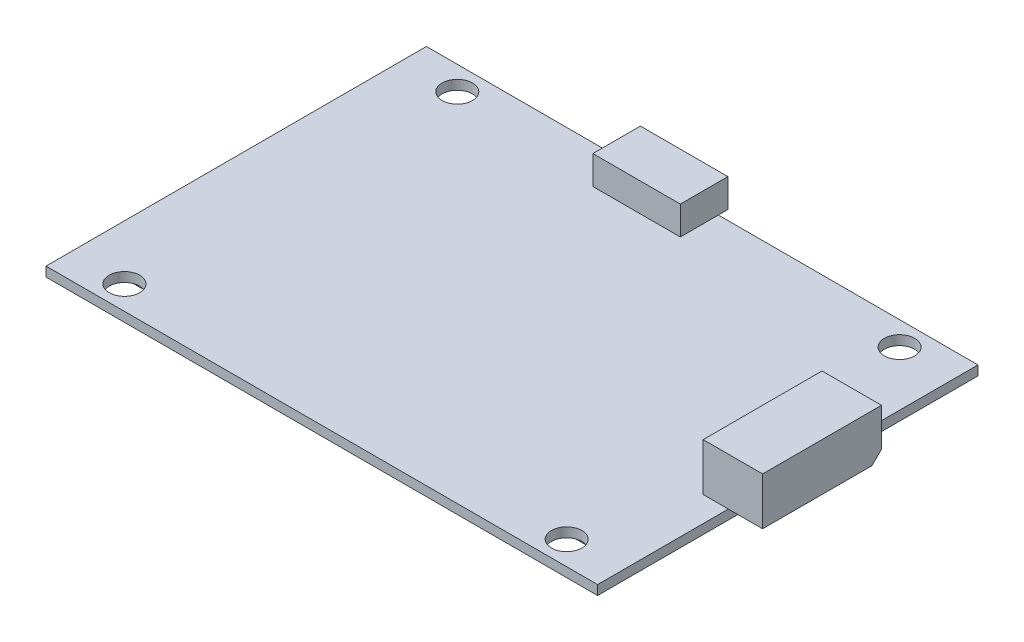
ISO-10303-21;
HEADER;
FILE_DESCRIPTION(('STEP AP214'),'2;1');
FILE_NAME('part.step','',(''),(''),'','','');
FILE_SCHEMA(('AUTOMOTIVE_DESIGN { 1 0 10303 214 1 1 1 1 }'));
ENDSEC;
DATA;
#1=APPLICATION_CONTEXT('core data for automotive mechanical design processes');
#2=APPLICATION_PROTOCOL_DEFINITION('international standard','automotive_design',2000,#1);
#3=PRODUCT_CONTEXT('',#1,'mechanical');
#4=PRODUCT('Part','Part','',(#3));
#5=PRODUCT_RELATED_PRODUCT_CATEGORY('part','',(#4));
#6=PRODUCT_DEFINITION_FORMATION('','',#4);
#7=PRODUCT_DEFINITION_CONTEXT('part definition',#1,'design');
#8=PRODUCT_DEFINITION('design','',#6,#7);
#9=PRODUCT_DEFINITION_SHAPE('','',#8);
#10=(LENGTH_UNIT() NAMED_UNIT(*) SI_UNIT(.MILLI.,.METRE.));
#11=(NAMED_UNIT(*) PLANE_ANGLE_UNIT() SI_UNIT($,.RADIAN.));
#12=(NAMED_UNIT(*) SI_UNIT($,.STERADIAN.) SOLID_ANGLE_UNIT());
#13=UNCERTAINTY_MEASURE_WITH_UNIT(LENGTH_MEASURE(1.E-05),#10,'distance_accuracy_value','');
#14=(GEOMETRIC_REPRESENTATION_CONTEXT(3) GLOBAL_UNCERTAINTY_ASSIGNED_CONTEXT((#13)) GLOBAL_UNIT_ASSIGNED_CONTEXT((#10,
#11,#12)) REPRESENTATION_CONTEXT('',''));
#15=CARTESIAN_POINT('',(0.,0.,0.));
#16=DIRECTION('',(0.,0.,1.));
#17=DIRECTION('',(1.,0.,0.));
#18=AXIS2_PLACEMENT_3D('',#15,#16,#17);
#19=CARTESIAN_POINT('',(0.,0.,0.));
#20=DIRECTION('',(0.,1.,0.));
#21=DIRECTION('',(0.,0.,1.));
#22=AXIS2_PLACEMENT_3D('',#19,#20,#21);
#23=PLANE('',#22);
#24=CARTESIAN_POINT('',(23.25,0.,-17.5));
#25=DIRECTION('',(0.,1.,0.));
#26=DIRECTION('',(0.,0.,1.));
#27=AXIS2_PLACEMENT_3D('',#24,#25,#26);
#28=CIRCLE('',#27,1.6);
#29=CARTESIAN_POINT('',(23.25,0.,-15.9));
#30=VERTEX_POINT('',#29);
#31=EDGE_CURVE('E923',#30,#30,#28,.T.);
#32=ORIENTED_EDGE('',*,*,#31,.T.);
#33=EDGE_LOOP('',(#32));
#34=FACE_BOUND('',#33,.T.);
#35=CARTESIAN_POINT('',(23.25,0.,17.5));
#36=DIRECTION('',(0.,1.,0.));
#37=DIRECTION('',(0.,0.,1.));
#38=AXIS2_PLACEMENT_3D('',#35,#36,#37);
#39=CIRCLE('',#38,1.6);
#40=CARTESIAN_POINT('',(23.25,0.,19.1));
#41=VERTEX_POINT('',#40);
#42=EDGE_CURVE('E924',#41,#41,#39,.T.);
#43=ORIENTED_EDGE('',*,*,#42,.T.);
#44=EDGE_LOOP('',(#43));
#45=FACE_BOUND('',#44,.T.);
#46=CARTESIAN_POINT('',(-23.25,0.,17.5));
#47=DIRECTION('',(0.,1.,0.));
#48=DIRECTION('',(0.,0.,1.));
#49=AXIS2_PLACEMENT_3D('',#46,#47,#48);
#50=CIRCLE('',#49,1.6);
#51=CARTESIAN_POINT('',(-23.25,0.,19.1));
#52=VERTEX_POINT('',#51);
#53=EDGE_CURVE('E928',#52,#52,#50,.T.);
#54=ORIENTED_EDGE('',*,*,#53,.T.);
#55=EDGE_LOOP('',(#54));
#56=FACE_BOUND('',#55,.T.);
#57=CARTESIAN_POINT('',(-23.25,0.,-17.5));
#58=DIRECTION('',(0.,1.,0.));
#59=DIRECTION('',(0.,0.,1.));
#60=AXIS2_PLACEMENT_3D('',#57,#58,#59);
#61=CIRCLE('',#60,1.6);
#62=CARTESIAN_POINT('',(-23.25,0.,-15.9));
#63=VERTEX_POINT('',#62);
#64=EDGE_CURVE('E943',#63,#63,#61,.T.);
#65=ORIENTED_EDGE('',*,*,#64,.T.);
#66=EDGE_LOOP('',(#65));
#67=FACE_BOUND('',#66,.T.);
#68=DIRECTION('',(0.,0.,-1.));
#69=VECTOR('',#68,1.);
#70=CARTESIAN_POINT('',(17.5,0.,12.));
#71=LINE('',#70,#69);
#72=CARTESIAN_POINT('',(17.5,0.,12.));
#73=VERTEX_POINT('',#72);
#74=CARTESIAN_POINT('',(17.5,0.,5.4));
#75=VERTEX_POINT('',#74);
#76=EDGE_CURVE('E260',#73,#75,#71,.T.);
#77=ORIENTED_EDGE('',*,*,#76,.F.);
#78=DIRECTION('',(-1.,0.,0.));
#79=VECTOR('',#78,1.);
#80=CARTESIAN_POINT('',(17.5,0.,12.));
#81=LINE('',#80,#79);
#82=CARTESIAN_POINT('',(22.5,0.,12.));
#83=VERTEX_POINT('',#82);
#84=EDGE_CURVE('E273',#83,#73,#81,.T.);
#85=ORIENTED_EDGE('',*,*,#84,.F.);
#86=DIRECTION('',(0.,0.,1.));
#87=VECTOR('',#86,1.);
#88=CARTESIAN_POINT('',(22.5,0.,12.));
#89=LINE('',#88,#87);
#90=CARTESIAN_POINT('',(22.5,0.,5.4));
#91=VERTEX_POINT('',#90);
#92=EDGE_CURVE('E282',#91,#83,#89,.T.);
#93=ORIENTED_EDGE('',*,*,#92,.F.);
#94=DIRECTION('',(1.,0.,0.));
#95=VECTOR('',#94,1.);
#96=CARTESIAN_POINT('',(17.5,0.,5.4));
#97=LINE('',#96,#95);
#98=EDGE_CURVE('E263',#75,#91,#97,.T.);
#99=ORIENTED_EDGE('',*,*,#98,.F.);
#100=EDGE_LOOP('',(#77,#85,#93,#99));
#101=FACE_BOUND('',#100,.T.);
#102=DIRECTION('',(0.,0.,-1.));
#103=VECTOR('',#102,1.);
#104=CARTESIAN_POINT('',(-28.,0.,12.));
#105=LINE('',#104,#103);
#106=CARTESIAN_POINT('',(-28.,0.,12.));
#107=VERTEX_POINT('',#106);
#108=CARTESIAN_POINT('',(-28.,0.,5.4));
#109=VERTEX_POINT('',#108);
#110=EDGE_CURVE('E331',#107,#109,#105,.T.);
#111=ORIENTED_EDGE('',*,*,#110,.F.);
#112=DIRECTION('',(-1.,0.,0.));
#113=VECTOR('',#112,1.);
#114=CARTESIAN_POINT('',(-28.,0.,12.));
#115=LINE('',#114,#113);
#116=CARTESIAN_POINT('',(-23.,0.,12.));
#117=VERTEX_POINT('',#116);
#118=EDGE_CURVE('E336',#117,#107,#115,.T.);
#119=ORIENTED_EDGE('',*,*,#118,.F.);
#120=DIRECTION('',(0.,0.,1.));
#121=VECTOR('',#120,1.);
#122=CARTESIAN_POINT('',(-23.,0.,12.));
#123=LINE('',#122,#121);
#124=CARTESIAN_POINT('',(-23.,0.,5.4));
#125=VERTEX_POINT('',#124);
#126=EDGE_CURVE('E348',#125,#117,#123,.T.);
#127=ORIENTED_EDGE('',*,*,#126,.F.);
#128=DIRECTION('',(1.,0.,0.));
#129=VECTOR('',#128,1.);
#130=CARTESIAN_POINT('',(-28.,0.,5.4));
#131=LINE('',#130,#129);
#132=EDGE_CURVE('E345',#109,#125,#131,.T.);
#133=ORIENTED_EDGE('',*,*,#132,.F.);
#134=EDGE_LOOP('',(#111,#119,#127,#133));
#135=FACE_BOUND('',#134,.T.);
#136=DIRECTION('',(0.,0.,1.));
#137=VECTOR('',#136,1.);
#138=CARTESIAN_POINT('',(-29.,0.,20.));
#139=LINE('',#138,#137);
#140=CARTESIAN_POINT('',(-29.,0.,-20.));
#141=VERTEX_POINT('',#140);
#142=CARTESIAN_POINT('',(-29.,0.,20.));
#143=VERTEX_POINT('',#142);
#144=EDGE_CURVE('E432',#141,#143,#139,.T.);
#145=ORIENTED_EDGE('',*,*,#144,.F.);
#146=DIRECTION('',(-1.,0.,0.));
#147=VECTOR('',#146,1.);
#148=CARTESIAN_POINT('',(29.,0.,-20.));
#149=LINE('',#148,#147);
#150=CARTESIAN_POINT('',(29.,0.,-20.));
#151=VERTEX_POINT('',#150);
#152=EDGE_CURVE('E437',#151,#141,#149,.T.);
#153=ORIENTED_EDGE('',*,*,#152,.F.);
#154=DIRECTION('',(0.,0.,-1.));
#155=VECTOR('',#154,1.);
#156=CARTESIAN_POINT('',(29.,0.,20.));
#157=LINE('',#156,#155);
#158=CARTESIAN_POINT('',(29.,0.,20.));
#159=VERTEX_POINT('',#158);
#160=EDGE_CURVE('E453',#159,#151,#157,.T.);
#161=ORIENTED_EDGE('',*,*,#160,.F.);
#162=DIRECTION('',(1.,0.,0.));
#163=VECTOR('',#162,1.);
#164=CARTESIAN_POINT('',(29.,0.,20.));
#165=LINE('',#164,#163);
#166=EDGE_CURVE('E451',#143,#159,#165,.T.);
#167=ORIENTED_EDGE('',*,*,#166,.F.);
#168=EDGE_LOOP('',(#145,#153,#161,#167));
#169=FACE_BOUND('',#168,.T.);
#170=DIRECTION('',(0.,0.,-1.));
#171=VECTOR('',#170,1.);
#172=CARTESIAN_POINT('',(-28.,0.,-5.6));
#173=LINE('',#172,#171);
#174=CARTESIAN_POINT('',(-28.,0.,-5.6));
#175=VERTEX_POINT('',#174);
#176=CARTESIAN_POINT('',(-28.,0.,-12.2));
#177=VERTEX_POINT('',#176);
#178=EDGE_CURVE('E298',#175,#177,#173,.T.);
#179=ORIENTED_EDGE('',*,*,#178,.F.);
#180=DIRECTION('',(-1.,0.,0.));
#181=VECTOR('',#180,1.);
#182=CARTESIAN_POINT('',(-28.,0.,-5.6));
#183=LINE('',#182,#181);
#184=CARTESIAN_POINT('',(-23.,0.,-5.6));
#185=VERTEX_POINT('',#184);
#186=EDGE_CURVE('E303',#185,#175,#183,.T.);
#187=ORIENTED_EDGE('',*,*,#186,.F.);
#188=DIRECTION('',(0.,0.,1.));
#189=VECTOR('',#188,1.);
#190=CARTESIAN_POINT('',(-23.,0.,-5.6));
#191=LINE('',#190,#189);
#192=CARTESIAN_POINT('',(-23.,0.,-12.2));
#193=VERTEX_POINT('',#192);
#194=EDGE_CURVE('E315',#193,#185,#191,.T.);
#195=ORIENTED_EDGE('',*,*,#194,.F.);
#196=DIRECTION('',(1.,0.,0.));
#197=VECTOR('',#196,1.);
#198=CARTESIAN_POINT('',(-28.,0.,-12.2));
#199=LINE('',#198,#197);
#200=EDGE_CURVE('E312',#177,#193,#199,.T.);
#201=ORIENTED_EDGE('',*,*,#200,.F.);
#202=EDGE_LOOP('',(#179,#187,#195,#201));
#203=FACE_BOUND('',#202,.T.);
#204=DIRECTION('',(0.,0.,-1.));
#205=VECTOR('',#204,1.);
#206=CARTESIAN_POINT('',(17.5,0.,-5.6));
#207=LINE('',#206,#205);
#208=CARTESIAN_POINT('',(17.5,0.,-5.6));
#209=VERTEX_POINT('',#208);
#210=CARTESIAN_POINT('',(17.5,0.,-12.2));
#211=VERTEX_POINT('',#210);
#212=EDGE_CURVE('E259',#209,#211,#207,.T.);
#213=ORIENTED_EDGE('',*,*,#212,.F.);
#214=DIRECTION('',(-1.,0.,0.));
#215=VECTOR('',#214,1.);
#216=CARTESIAN_POINT('',(17.5,0.,-5.6));
#217=LINE('',#216,#215);
#218=CARTESIAN_POINT('',(22.5,0.,-5.6));
#219=VERTEX_POINT('',#218);
#220=EDGE_CURVE('E256',#219,#209,#217,.T.);
#221=ORIENTED_EDGE('',*,*,#220,.F.);
#222=DIRECTION('',(0.,0.,1.));
#223=VECTOR('',#222,1.);
#224=CARTESIAN_POINT('',(22.5,0.,-5.6));
#225=LINE('',#224,#223);
#226=CARTESIAN_POINT('',(22.5,0.,-12.2));
#227=VERTEX_POINT('',#226);
#228=EDGE_CURVE('E53',#227,#219,#225,.T.);
#229=ORIENTED_EDGE('',*,*,#228,.F.);
#230=DIRECTION('',(1.,0.,0.));
#231=VECTOR('',#230,1.);
#232=CARTESIAN_POINT('',(17.5,0.,-12.2));
#233=LINE('',#232,#231);
#234=EDGE_CURVE('E48',#211,#227,#233,.T.);
#235=ORIENTED_EDGE('',*,*,#234,.F.);
#236=EDGE_LOOP('',(#213,#221,#229,#235));
#237=FACE_BOUND('',#236,.T.);
#238=ADVANCED_FACE('F33',(#34,#45,#56,#67,#101,#135,#169,#203,#237),#23,.F.);
#239=CARTESIAN_POINT('',(0.,1.,0.));
#240=DIRECTION('',(0.,1.,0.));
#241=DIRECTION('',(0.,0.,1.));
#242=AXIS2_PLACEMENT_3D('',#239,#240,#241);
#243=PLANE('',#242);
#244=CARTESIAN_POINT('',(23.25,1.,-17.5));
#245=DIRECTION('',(0.,1.,0.));
#246=DIRECTION('',(0.,0.,1.));
#247=AXIS2_PLACEMENT_3D('',#244,#245,#246);
#248=CIRCLE('',#247,1.6);
#249=CARTESIAN_POINT('',(23.25,1.,-15.9));
#250=VERTEX_POINT('',#249);
#251=EDGE_CURVE('E921',#250,#250,#248,.T.);
#252=ORIENTED_EDGE('',*,*,#251,.F.);
#253=EDGE_LOOP('',(#252));
#254=FACE_BOUND('',#253,.T.);
#255=CARTESIAN_POINT('',(23.25,1.,17.5));
#256=DIRECTION('',(0.,1.,0.));
#257=DIRECTION('',(0.,0.,1.));
#258=AXIS2_PLACEMENT_3D('',#255,#256,#257);
#259=CIRCLE('',#258,1.6);
#260=CARTESIAN_POINT('',(23.25,1.,19.1));
#261=VERTEX_POINT('',#260);
#262=EDGE_CURVE('E951',#261,#261,#259,.T.);
#263=ORIENTED_EDGE('',*,*,#262,.F.);
#264=EDGE_LOOP('',(#263));
#265=FACE_BOUND('',#264,.T.);
#266=CARTESIAN_POINT('',(-23.25,1.,17.5));
#267=DIRECTION('',(0.,1.,0.));
#268=DIRECTION('',(0.,0.,1.));
#269=AXIS2_PLACEMENT_3D('',#266,#267,#268);
#270=CIRCLE('',#269,1.6);
#271=CARTESIAN_POINT('',(-23.25,1.,19.1));
#272=VERTEX_POINT('',#271);
#273=EDGE_CURVE('E949',#272,#272,#270,.T.);
#274=ORIENTED_EDGE('',*,*,#273,.F.);
#275=EDGE_LOOP('',(#274));
#276=FACE_BOUND('',#275,.T.);
#277=CARTESIAN_POINT('',(-23.25,1.,-17.5));
#278=DIRECTION('',(0.,1.,0.));
#279=DIRECTION('',(0.,0.,1.));
#280=AXIS2_PLACEMENT_3D('',#277,#278,#279);
#281=CIRCLE('',#280,1.6);
#282=CARTESIAN_POINT('',(-23.25,1.,-15.9));
#283=VERTEX_POINT('',#282);
#284=EDGE_CURVE('E946',#283,#283,#281,.T.);
#285=ORIENTED_EDGE('',*,*,#284,.F.);
#286=EDGE_LOOP('',(#285));
#287=FACE_BOUND('',#286,.T.);
#288=DIRECTION('',(1.,0.,0.));
#289=VECTOR('',#288,1.);
#290=CARTESIAN_POINT('',(-7.50000000000001,1.,-16.));
#291=LINE('',#290,#289);
#292=CARTESIAN_POINT('',(-7.50000000000001,1.,-16.));
#293=VERTEX_POINT('',#292);
#294=CARTESIAN_POINT('',(1.69999999999999,1.,-16.));
#295=VERTEX_POINT('',#294);
#296=EDGE_CURVE('E378',#293,#295,#291,.T.);
#297=ORIENTED_EDGE('',*,*,#296,.F.);
#298=DIRECTION('',(0.,0.,-1.));
#299=VECTOR('',#298,1.);
#300=CARTESIAN_POINT('',(-7.5,1.,0.));
#301=LINE('',#300,#299);
#302=CARTESIAN_POINT('',(-7.50000000000001,1.,-20.));
#303=VERTEX_POINT('',#302);
#304=EDGE_CURVE('E11',#293,#303,#301,.T.);
#305=ORIENTED_EDGE('',*,*,#304,.T.);
#306=DIRECTION('',(-1.,0.,0.));
#307=VECTOR('',#306,1.);
#308=CARTESIAN_POINT('',(29.,1.,-20.));
#309=LINE('',#308,#307);
#310=CARTESIAN_POINT('',(-29.,1.,-20.));
#311=VERTEX_POINT('',#310);
#312=EDGE_CURVE('E442',#303,#311,#309,.T.);
#313=ORIENTED_EDGE('',*,*,#312,.T.);
#314=DIRECTION('',(0.,0.,1.));
#315=VECTOR('',#314,1.);
#316=CARTESIAN_POINT('',(-29.,1.,20.));
#317=LINE('',#316,#315);
#318=CARTESIAN_POINT('',(-29.,1.,20.));
#319=VERTEX_POINT('',#318);
#320=EDGE_CURVE('E433',#311,#319,#317,.T.);
#321=ORIENTED_EDGE('',*,*,#320,.T.);
#322=DIRECTION('',(1.,0.,0.));
#323=VECTOR('',#322,1.);
#324=CARTESIAN_POINT('',(29.,1.,20.));
#325=LINE('',#324,#323);
#326=CARTESIAN_POINT('',(29.,1.,20.));
#327=VERTEX_POINT('',#326);
#328=EDGE_CURVE('E436',#319,#327,#325,.T.);
#329=ORIENTED_EDGE('',*,*,#328,.T.);
#330=DIRECTION('',(0.,0.,-1.));
#331=VECTOR('',#330,1.);
#332=CARTESIAN_POINT('',(29.,1.,20.));
#333=LINE('',#332,#331);
#334=CARTESIAN_POINT('',(29.,1.,6.25));
#335=VERTEX_POINT('',#334);
#336=EDGE_CURVE('E440',#327,#335,#333,.T.);
#337=ORIENTED_EDGE('',*,*,#336,.T.);
#338=DIRECTION('',(1.,0.,0.));
#339=VECTOR('',#338,1.);
#340=CARTESIAN_POINT('',(26.35,1.,6.25));
#341=LINE('',#340,#339);
#342=CARTESIAN_POINT('',(26.35,1.,6.25));
#343=VERTEX_POINT('',#342);
#344=EDGE_CURVE('E411',#343,#335,#341,.T.);
#345=ORIENTED_EDGE('',*,*,#344,.F.);
#346=DIRECTION('',(0.,0.,1.));
#347=VECTOR('',#346,1.);
#348=CARTESIAN_POINT('',(26.35,1.,-6.25));
#349=LINE('',#348,#347);
#350=CARTESIAN_POINT('',(26.35,1.,-6.25));
#351=VERTEX_POINT('',#350);
#352=EDGE_CURVE('E396',#351,#343,#349,.T.);
#353=ORIENTED_EDGE('',*,*,#352,.F.);
#354=DIRECTION('',(-1.,0.,0.));
#355=VECTOR('',#354,1.);
#356=CARTESIAN_POINT('',(26.35,1.,-6.25));
#357=LINE('',#356,#355);
#358=CARTESIAN_POINT('',(29.,1.,-6.25));
#359=VERTEX_POINT('',#358);
#360=EDGE_CURVE('E416',#359,#351,#357,.T.);
#361=ORIENTED_EDGE('',*,*,#360,.F.);
#362=CARTESIAN_POINT('',(29.,1.,-20.));
#363=VERTEX_POINT('',#362);
#364=EDGE_CURVE('E439',#359,#363,#333,.T.);
#365=ORIENTED_EDGE('',*,*,#364,.T.);
#366=CARTESIAN_POINT('',(1.69999999999999,1.,-20.));
#367=VERTEX_POINT('',#366);
#368=EDGE_CURVE('E444',#363,#367,#309,.T.);
#369=ORIENTED_EDGE('',*,*,#368,.T.);
#370=DIRECTION('',(0.,0.,-1.));
#371=VECTOR('',#370,1.);
#372=CARTESIAN_POINT('',(1.69999999999999,1.,-21.));
#373=LINE('',#372,#371);
#374=EDGE_CURVE('E382',#295,#367,#373,.T.);
#375=ORIENTED_EDGE('',*,*,#374,.F.);
#376=EDGE_LOOP('',(#297,#305,#313,#321,#329,#337,#345,#353,#361,#365,#369,#375));
#377=FACE_BOUND('',#376,.T.);
#378=ADVANCED_FACE('F505',(#254,#265,#276,#287,#377),#243,.T.);
#379=CARTESIAN_POINT('',(-29.,1.,20.));
#380=DIRECTION('',(1.,0.,0.));
#381=DIRECTION('',(0.,0.,-1.));
#382=AXIS2_PLACEMENT_3D('',#379,#380,#381);
#383=PLANE('',#382);
#384=ORIENTED_EDGE('',*,*,#144,.T.);
#385=DIRECTION('',(0.,-1.,0.));
#386=VECTOR('',#385,1.);
#387=CARTESIAN_POINT('',(-29.,1.,20.));
#388=LINE('',#387,#386);
#389=EDGE_CURVE('E420',#319,#143,#388,.T.);
#390=ORIENTED_EDGE('',*,*,#389,.F.);
#391=ORIENTED_EDGE('',*,*,#320,.F.);
#392=DIRECTION('',(0.,-1.,0.));
#393=VECTOR('',#392,1.);
#394=CARTESIAN_POINT('',(-29.,1.,-20.));
#395=LINE('',#394,#393);
#396=EDGE_CURVE('E447',#311,#141,#395,.T.);
#397=ORIENTED_EDGE('',*,*,#396,.T.);
#398=EDGE_LOOP('',(#384,#390,#391,#397));
#399=FACE_BOUND('',#398,.T.);
#400=ADVANCED_FACE('F522',(#399),#383,.F.);
#401=CARTESIAN_POINT('',(29.,1.,20.));
#402=DIRECTION('',(0.,0.,-1.));
#403=DIRECTION('',(-1.,0.,0.));
#404=AXIS2_PLACEMENT_3D('',#401,#402,#403);
#405=PLANE('',#404);
#406=ORIENTED_EDGE('',*,*,#166,.T.);
#407=DIRECTION('',(0.,-1.,0.));
#408=VECTOR('',#407,1.);
#409=CARTESIAN_POINT('',(29.,1.,20.));
#410=LINE('',#409,#408);
#411=EDGE_CURVE('E461',#327,#159,#410,.T.);
#412=ORIENTED_EDGE('',*,*,#411,.F.);
#413=ORIENTED_EDGE('',*,*,#328,.F.);
#414=ORIENTED_EDGE('',*,*,#389,.T.);
#415=EDGE_LOOP('',(#406,#412,#413,#414));
#416=FACE_BOUND('',#415,.T.);
#417=ADVANCED_FACE('F569',(#416),#405,.F.);
#418=CARTESIAN_POINT('',(29.,1.,20.));
#419=DIRECTION('',(-1.,0.,0.));
#420=DIRECTION('',(0.,0.,1.));
#421=AXIS2_PLACEMENT_3D('',#418,#419,#420);
#422=PLANE('',#421);
#423=ORIENTED_EDGE('',*,*,#160,.T.);
#424=DIRECTION('',(0.,-1.,0.));
#425=VECTOR('',#424,1.);
#426=CARTESIAN_POINT('',(29.,1.,-20.));
#427=LINE('',#426,#425);
#428=EDGE_CURVE('E458',#363,#151,#427,.T.);
#429=ORIENTED_EDGE('',*,*,#428,.F.);
#430=ORIENTED_EDGE('',*,*,#364,.F.);
#431=DIRECTION('',(0.,-1.,0.));
#432=VECTOR('',#431,1.);
#433=CARTESIAN_POINT('',(29.,6.,-6.25));
#434=LINE('',#433,#432);
#435=CARTESIAN_POINT('',(29.,2.,-6.25));
#436=VERTEX_POINT('',#435);
#437=EDGE_CURVE('E419',#436,#359,#434,.T.);
#438=ORIENTED_EDGE('',*,*,#437,.F.);
#439=DIRECTION('',(0.,0.707106781186548,-0.707106781186548));
#440=VECTOR('',#439,1.);
#441=CARTESIAN_POINT('',(29.,-11.625,7.375));
#442=LINE('',#441,#440);
#443=CARTESIAN_POINT('',(29.,1.,-5.25));
#444=VERTEX_POINT('',#443);
#445=EDGE_CURVE('E41',#436,#444,#442,.F.);
#446=ORIENTED_EDGE('',*,*,#445,.T.);
#447=EDGE_CURVE('E443',#335,#444,#333,.T.);
#448=ORIENTED_EDGE('',*,*,#447,.F.);
#449=ORIENTED_EDGE('',*,*,#336,.F.);
#450=ORIENTED_EDGE('',*,*,#411,.T.);
#451=EDGE_LOOP('',(#423,#429,#430,#438,#446,#448,#449,#450));
#452=FACE_BOUND('',#451,.T.);
#453=ADVANCED_FACE('F477',(#452),#422,.F.);
#454=CARTESIAN_POINT('',(29.,1.,-20.));
#455=DIRECTION('',(0.,0.,1.));
#456=DIRECTION('',(1.,0.,0.));
#457=AXIS2_PLACEMENT_3D('',#454,#455,#456);
#458=PLANE('',#457);
#459=ORIENTED_EDGE('',*,*,#152,.T.);
#460=ORIENTED_EDGE('',*,*,#396,.F.);
#461=ORIENTED_EDGE('',*,*,#312,.F.);
#462=EDGE_CURVE('E448',#367,#303,#309,.T.);
#463=ORIENTED_EDGE('',*,*,#462,.F.);
#464=ORIENTED_EDGE('',*,*,#368,.F.);
#465=ORIENTED_EDGE('',*,*,#428,.T.);
#466=EDGE_LOOP('',(#459,#460,#461,#463,#464,#465));
#467=FACE_BOUND('',#466,.T.);
#468=ADVANCED_FACE('F517',(#467),#458,.F.);
#469=CARTESIAN_POINT('',(0.,1.,0.));
#470=DIRECTION('',(0.,1.,0.));
#471=DIRECTION('',(0.,0.,1.));
#472=AXIS2_PLACEMENT_3D('',#469,#470,#471);
#473=PLANE('',#472);
#474=ORIENTED_EDGE('',*,*,#447,.T.);
#475=DIRECTION('',(1.,0.,0.));
#476=VECTOR('',#475,1.);
#477=CARTESIAN_POINT('',(0.,1.,-5.25));
#478=LINE('',#477,#476);
#479=CARTESIAN_POINT('',(32.6,1.,-5.25));
#480=VERTEX_POINT('',#479);
#481=EDGE_CURVE('E470',#444,#480,#478,.T.);
#482=ORIENTED_EDGE('',*,*,#481,.T.);
#483=DIRECTION('',(0.,0.,-1.));
#484=VECTOR('',#483,1.);
#485=CARTESIAN_POINT('',(32.6,1.,-6.25));
#486=LINE('',#485,#484);
#487=CARTESIAN_POINT('',(32.6,1.,6.25));
#488=VERTEX_POINT('',#487);
#489=EDGE_CURVE('E401',#488,#480,#486,.T.);
#490=ORIENTED_EDGE('',*,*,#489,.F.);
#491=EDGE_CURVE('E410',#335,#488,#341,.T.);
#492=ORIENTED_EDGE('',*,*,#491,.F.);
#493=EDGE_LOOP('',(#474,#482,#490,#492));
#494=FACE_BOUND('',#493,.T.);
#495=ADVANCED_FACE('F485',(#494),#473,.F.);
#496=CARTESIAN_POINT('',(26.35,6.,-6.25));
#497=DIRECTION('',(1.,0.,0.));
#498=DIRECTION('',(0.,0.,-1.));
#499=AXIS2_PLACEMENT_3D('',#496,#497,#498);
#500=PLANE('',#499);
#501=ORIENTED_EDGE('',*,*,#352,.T.);
#502=DIRECTION('',(0.,-1.,0.));
#503=VECTOR('',#502,1.);
#504=CARTESIAN_POINT('',(26.35,6.,6.25));
#505=LINE('',#504,#503);
#506=CARTESIAN_POINT('',(26.35,6.,6.25));
#507=VERTEX_POINT('',#506);
#508=EDGE_CURVE('E429',#507,#343,#505,.T.);
#509=ORIENTED_EDGE('',*,*,#508,.F.);
#510=DIRECTION('',(0.,0.,1.));
#511=VECTOR('',#510,1.);
#512=CARTESIAN_POINT('',(26.35,6.,-6.25));
#513=LINE('',#512,#511);
#514=CARTESIAN_POINT('',(26.35,6.,-6.25));
#515=VERTEX_POINT('',#514);
#516=EDGE_CURVE('E397',#515,#507,#513,.T.);
#517=ORIENTED_EDGE('',*,*,#516,.F.);
#518=DIRECTION('',(0.,-1.,0.));
#519=VECTOR('',#518,1.);
#520=CARTESIAN_POINT('',(26.35,6.,-6.25));
#521=LINE('',#520,#519);
#522=EDGE_CURVE('E407',#515,#351,#521,.T.);
#523=ORIENTED_EDGE('',*,*,#522,.T.);
#524=EDGE_LOOP('',(#501,#509,#517,#523));
#525=FACE_BOUND('',#524,.T.);
#526=ADVANCED_FACE('F544',(#525),#500,.F.);
#527=CARTESIAN_POINT('',(26.35,6.,6.25));
#528=DIRECTION('',(0.,0.,-1.));
#529=DIRECTION('',(-1.,0.,0.));
#530=AXIS2_PLACEMENT_3D('',#527,#528,#529);
#531=PLANE('',#530);
#532=ORIENTED_EDGE('',*,*,#344,.T.);
#533=ORIENTED_EDGE('',*,*,#491,.T.);
#534=DIRECTION('',(0.,-1.,0.));
#535=VECTOR('',#534,1.);
#536=CARTESIAN_POINT('',(32.6,6.,6.25));
#537=LINE('',#536,#535);
#538=CARTESIAN_POINT('',(32.6,6.,6.25));
#539=VERTEX_POINT('',#538);
#540=EDGE_CURVE('E426',#539,#488,#537,.T.);
#541=ORIENTED_EDGE('',*,*,#540,.F.);
#542=DIRECTION('',(1.,0.,0.));
#543=VECTOR('',#542,1.);
#544=CARTESIAN_POINT('',(26.35,6.,6.25));
#545=LINE('',#544,#543);
#546=EDGE_CURVE('E400',#507,#539,#545,.T.);
#547=ORIENTED_EDGE('',*,*,#546,.F.);
#548=ORIENTED_EDGE('',*,*,#508,.T.);
#549=EDGE_LOOP('',(#532,#533,#541,#547,#548));
#550=FACE_BOUND('',#549,.T.);
#551=ADVANCED_FACE('F502',(#550),#531,.F.);
#552=CARTESIAN_POINT('',(32.6,6.,-6.25));
#553=DIRECTION('',(-1.,0.,0.));
#554=DIRECTION('',(0.,0.,1.));
#555=AXIS2_PLACEMENT_3D('',#552,#553,#554);
#556=PLANE('',#555);
#557=ORIENTED_EDGE('',*,*,#489,.T.);
#558=DIRECTION('',(0.,-0.707106781186548,0.707106781186548));
#559=VECTOR('',#558,1.);
#560=CARTESIAN_POINT('',(32.6,2.,-6.25));
#561=LINE('',#560,#559);
#562=CARTESIAN_POINT('',(32.6,2.,-6.25));
#563=VERTEX_POINT('',#562);
#564=EDGE_CURVE('E472',#480,#563,#561,.F.);
#565=ORIENTED_EDGE('',*,*,#564,.T.);
#566=DIRECTION('',(0.,-1.,0.));
#567=VECTOR('',#566,1.);
#568=CARTESIAN_POINT('',(32.6,6.,-6.25));
#569=LINE('',#568,#567);
#570=CARTESIAN_POINT('',(32.6,6.,-6.25));
#571=VERTEX_POINT('',#570);
#572=EDGE_CURVE('E423',#571,#563,#569,.T.);
#573=ORIENTED_EDGE('',*,*,#572,.F.);
#574=DIRECTION('',(0.,0.,-1.));
#575=VECTOR('',#574,1.);
#576=CARTESIAN_POINT('',(32.6,6.,-6.25));
#577=LINE('',#576,#575);
#578=EDGE_CURVE('E403',#539,#571,#577,.T.);
#579=ORIENTED_EDGE('',*,*,#578,.F.);
#580=ORIENTED_EDGE('',*,*,#540,.T.);
#581=EDGE_LOOP('',(#557,#565,#573,#579,#580));
#582=FACE_BOUND('',#581,.T.);
#583=ADVANCED_FACE('F490',(#582),#556,.F.);
#584=CARTESIAN_POINT('',(26.35,6.,-6.25));
#585=DIRECTION('',(0.,0.,1.));
#586=DIRECTION('',(1.,0.,0.));
#587=AXIS2_PLACEMENT_3D('',#584,#585,#586);
#588=PLANE('',#587);
#589=ORIENTED_EDGE('',*,*,#572,.T.);
#590=DIRECTION('',(-1.,0.,0.));
#591=VECTOR('',#590,1.);
#592=CARTESIAN_POINT('',(26.35,2.,-6.25));
#593=LINE('',#592,#591);
#594=EDGE_CURVE('E467',#563,#436,#593,.T.);
#595=ORIENTED_EDGE('',*,*,#594,.T.);
#596=ORIENTED_EDGE('',*,*,#437,.T.);
#597=ORIENTED_EDGE('',*,*,#360,.T.);
#598=ORIENTED_EDGE('',*,*,#522,.F.);
#599=DIRECTION('',(-1.,0.,0.));
#600=VECTOR('',#599,1.);
#601=CARTESIAN_POINT('',(26.35,6.,-6.25));
#602=LINE('',#601,#600);
#603=EDGE_CURVE('E405',#571,#515,#602,.T.);
#604=ORIENTED_EDGE('',*,*,#603,.F.);
#605=EDGE_LOOP('',(#589,#595,#596,#597,#598,#604));
#606=FACE_BOUND('',#605,.T.);
#607=ADVANCED_FACE('F494',(#606),#588,.F.);
#608=CARTESIAN_POINT('',(0.,6.,0.));
#609=DIRECTION('',(0.,1.,0.));
#610=DIRECTION('',(0.,0.,1.));
#611=AXIS2_PLACEMENT_3D('',#608,#609,#610);
#612=PLANE('',#611);
#613=ORIENTED_EDGE('',*,*,#516,.T.);
#614=ORIENTED_EDGE('',*,*,#546,.T.);
#615=ORIENTED_EDGE('',*,*,#578,.T.);
#616=ORIENTED_EDGE('',*,*,#603,.T.);
#617=EDGE_LOOP('',(#613,#614,#615,#616));
#618=FACE_BOUND('',#617,.T.);
#619=ADVANCED_FACE('F498',(#618),#612,.T.);
#620=CARTESIAN_POINT('',(26.35,2.,-6.25));
#621=DIRECTION('',(0.,0.707106781186547,0.707106781186547));
#622=DIRECTION('',(-1.,0.,0.));
#623=AXIS2_PLACEMENT_3D('',#620,#621,#622);
#624=PLANE('',#623);
#625=ORIENTED_EDGE('',*,*,#564,.F.);
#626=ORIENTED_EDGE('',*,*,#481,.F.);
#627=ORIENTED_EDGE('',*,*,#445,.F.);
#628=ORIENTED_EDGE('',*,*,#594,.F.);
#629=EDGE_LOOP('',(#625,#626,#627,#628));
#630=FACE_BOUND('',#629,.T.);
#631=ADVANCED_FACE('F35',(#630),#624,.F.);
#632=CARTESIAN_POINT('',(0.,1.,0.));
#633=DIRECTION('',(0.,1.,0.));
#634=DIRECTION('',(0.,0.,1.));
#635=AXIS2_PLACEMENT_3D('',#632,#633,#634);
#636=PLANE('',#635);
#637=CARTESIAN_POINT('',(1.69999999999999,1.,-21.));
#638=VERTEX_POINT('',#637);
#639=EDGE_CURVE('E381',#367,#638,#373,.T.);
#640=ORIENTED_EDGE('',*,*,#639,.F.);
#641=ORIENTED_EDGE('',*,*,#462,.T.);
#642=DIRECTION('',(0.,0.,1.));
#643=VECTOR('',#642,1.);
#644=CARTESIAN_POINT('',(-7.50000000000001,1.,-21.));
#645=LINE('',#644,#643);
#646=CARTESIAN_POINT('',(-7.50000000000001,1.,-21.));
#647=VERTEX_POINT('',#646);
#648=EDGE_CURVE('E364',#647,#303,#645,.T.);
#649=ORIENTED_EDGE('',*,*,#648,.F.);
#650=DIRECTION('',(-1.,0.,0.));
#651=VECTOR('',#650,1.);
#652=CARTESIAN_POINT('',(-7.50000000000001,1.,-21.));
#653=LINE('',#652,#651);
#654=EDGE_CURVE('E369',#638,#647,#653,.T.);
#655=ORIENTED_EDGE('',*,*,#654,.F.);
#656=EDGE_LOOP('',(#640,#641,#649,#655));
#657=FACE_BOUND('',#656,.T.);
#658=ADVANCED_FACE('F527',(#657),#636,.F.);
#659=CARTESIAN_POINT('',(-7.50000000000001,4.,-21.));
#660=DIRECTION('',(1.,0.,0.));
#661=DIRECTION('',(0.,0.,-1.));
#662=AXIS2_PLACEMENT_3D('',#659,#660,#661);
#663=PLANE('',#662);
#664=ORIENTED_EDGE('',*,*,#648,.T.);
#665=ORIENTED_EDGE('',*,*,#304,.F.);
#666=DIRECTION('',(0.,-1.,0.));
#667=VECTOR('',#666,1.);
#668=CARTESIAN_POINT('',(-7.50000000000001,4.,-16.));
#669=LINE('',#668,#667);
#670=CARTESIAN_POINT('',(-7.50000000000001,4.,-16.));
#671=VERTEX_POINT('',#670);
#672=EDGE_CURVE('E393',#671,#293,#669,.T.);
#673=ORIENTED_EDGE('',*,*,#672,.F.);
#674=DIRECTION('',(0.,0.,1.));
#675=VECTOR('',#674,1.);
#676=CARTESIAN_POINT('',(-7.50000000000001,4.,-21.));
#677=LINE('',#676,#675);
#678=CARTESIAN_POINT('',(-7.50000000000001,4.,-21.));
#679=VERTEX_POINT('',#678);
#680=EDGE_CURVE('E365',#679,#671,#677,.T.);
#681=ORIENTED_EDGE('',*,*,#680,.F.);
#682=DIRECTION('',(0.,-1.,0.));
#683=VECTOR('',#682,1.);
#684=CARTESIAN_POINT('',(-7.50000000000001,4.,-21.));
#685=LINE('',#684,#683);
#686=EDGE_CURVE('E375',#679,#647,#685,.T.);
#687=ORIENTED_EDGE('',*,*,#686,.T.);
#688=EDGE_LOOP('',(#664,#665,#673,#681,#687));
#689=FACE_BOUND('',#688,.T.);
#690=ADVANCED_FACE('F530',(#689),#663,.F.);
#691=CARTESIAN_POINT('',(-7.50000000000001,4.,-16.));
#692=DIRECTION('',(0.,0.,-1.));
#693=DIRECTION('',(-1.,0.,0.));
#694=AXIS2_PLACEMENT_3D('',#691,#692,#693);
#695=PLANE('',#694);
#696=ORIENTED_EDGE('',*,*,#296,.T.);
#697=DIRECTION('',(0.,-1.,0.));
#698=VECTOR('',#697,1.);
#699=CARTESIAN_POINT('',(1.69999999999999,4.,-16.));
#700=LINE('',#699,#698);
#701=CARTESIAN_POINT('',(1.69999999999999,4.,-16.));
#702=VERTEX_POINT('',#701);
#703=EDGE_CURVE('E391',#702,#295,#700,.T.);
#704=ORIENTED_EDGE('',*,*,#703,.F.);
#705=DIRECTION('',(1.,0.,0.));
#706=VECTOR('',#705,1.);
#707=CARTESIAN_POINT('',(-7.50000000000001,4.,-16.));
#708=LINE('',#707,#706);
#709=EDGE_CURVE('E368',#671,#702,#708,.T.);
#710=ORIENTED_EDGE('',*,*,#709,.F.);
#711=ORIENTED_EDGE('',*,*,#672,.T.);
#712=EDGE_LOOP('',(#696,#704,#710,#711));
#713=FACE_BOUND('',#712,.T.);
#714=ADVANCED_FACE('F636',(#713),#695,.F.);
#715=CARTESIAN_POINT('',(1.69999999999999,4.,-21.));
#716=DIRECTION('',(-1.,0.,0.));
#717=DIRECTION('',(0.,0.,1.));
#718=AXIS2_PLACEMENT_3D('',#715,#716,#717);
#719=PLANE('',#718);
#720=ORIENTED_EDGE('',*,*,#374,.T.);
#721=ORIENTED_EDGE('',*,*,#639,.T.);
#722=DIRECTION('',(0.,-1.,0.));
#723=VECTOR('',#722,1.);
#724=CARTESIAN_POINT('',(1.69999999999999,4.,-21.));
#725=LINE('',#724,#723);
#726=CARTESIAN_POINT('',(1.69999999999999,4.,-21.));
#727=VERTEX_POINT('',#726);
#728=EDGE_CURVE('E388',#727,#638,#725,.T.);
#729=ORIENTED_EDGE('',*,*,#728,.F.);
#730=DIRECTION('',(0.,0.,-1.));
#731=VECTOR('',#730,1.);
#732=CARTESIAN_POINT('',(1.69999999999999,4.,-21.));
#733=LINE('',#732,#731);
#734=EDGE_CURVE('E371',#702,#727,#733,.T.);
#735=ORIENTED_EDGE('',*,*,#734,.F.);
#736=ORIENTED_EDGE('',*,*,#703,.T.);
#737=EDGE_LOOP('',(#720,#721,#729,#735,#736));
#738=FACE_BOUND('',#737,.T.);
#739=ADVANCED_FACE('F540',(#738),#719,.F.);
#740=CARTESIAN_POINT('',(-7.50000000000001,4.,-21.));
#741=DIRECTION('',(0.,0.,1.));
#742=DIRECTION('',(1.,0.,0.));
#743=AXIS2_PLACEMENT_3D('',#740,#741,#742);
#744=PLANE('',#743);
#745=ORIENTED_EDGE('',*,*,#654,.T.);
#746=ORIENTED_EDGE('',*,*,#686,.F.);
#747=DIRECTION('',(-1.,0.,0.));
#748=VECTOR('',#747,1.);
#749=CARTESIAN_POINT('',(-7.50000000000001,4.,-21.));
#750=LINE('',#749,#748);
#751=EDGE_CURVE('E373',#727,#679,#750,.T.);
#752=ORIENTED_EDGE('',*,*,#751,.F.);
#753=ORIENTED_EDGE('',*,*,#728,.T.);
#754=EDGE_LOOP('',(#745,#746,#752,#753));
#755=FACE_BOUND('',#754,.T.);
#756=ADVANCED_FACE('F536',(#755),#744,.F.);
#757=CARTESIAN_POINT('',(0.,4.,0.));
#758=DIRECTION('',(0.,1.,0.));
#759=DIRECTION('',(0.,0.,1.));
#760=AXIS2_PLACEMENT_3D('',#757,#758,#759);
#761=PLANE('',#760);
#762=ORIENTED_EDGE('',*,*,#680,.T.);
#763=ORIENTED_EDGE('',*,*,#709,.T.);
#764=ORIENTED_EDGE('',*,*,#734,.T.);
#765=ORIENTED_EDGE('',*,*,#751,.T.);
#766=EDGE_LOOP('',(#762,#763,#764,#765));
#767=FACE_BOUND('',#766,.T.);
#768=ADVANCED_FACE('F656',(#767),#761,.T.);
#769=CARTESIAN_POINT('',(-28.,-4.,12.));
#770=DIRECTION('',(1.,0.,0.));
#771=DIRECTION('',(0.,0.,-1.));
#772=AXIS2_PLACEMENT_3D('',#769,#770,#771);
#773=PLANE('',#772);
#774=ORIENTED_EDGE('',*,*,#110,.T.);
#775=DIRECTION('',(0.,1.,0.));
#776=VECTOR('',#775,1.);
#777=CARTESIAN_POINT('',(-28.,-4.,5.4));
#778=LINE('',#777,#776);
#779=CARTESIAN_POINT('',(-28.,-4.,5.4));
#780=VERTEX_POINT('',#779);
#781=EDGE_CURVE('E361',#780,#109,#778,.T.);
#782=ORIENTED_EDGE('',*,*,#781,.F.);
#783=DIRECTION('',(0.,0.,-1.));
#784=VECTOR('',#783,1.);
#785=CARTESIAN_POINT('',(-28.,-4.,12.));
#786=LINE('',#785,#784);
#787=CARTESIAN_POINT('',(-28.,-4.,12.));
#788=VERTEX_POINT('',#787);
#789=EDGE_CURVE('E332',#788,#780,#786,.T.);
#790=ORIENTED_EDGE('',*,*,#789,.F.);
#791=DIRECTION('',(0.,1.,0.));
#792=VECTOR('',#791,1.);
#793=CARTESIAN_POINT('',(-28.,-4.,12.));
#794=LINE('',#793,#792);
#795=EDGE_CURVE('E342',#788,#107,#794,.T.);
#796=ORIENTED_EDGE('',*,*,#795,.T.);
#797=EDGE_LOOP('',(#774,#782,#790,#796));
#798=FACE_BOUND('',#797,.T.);
#799=ADVANCED_FACE('F663',(#798),#773,.F.);
#800=CARTESIAN_POINT('',(-28.,-4.,5.4));
#801=DIRECTION('',(0.,0.,1.));
#802=DIRECTION('',(1.,0.,0.));
#803=AXIS2_PLACEMENT_3D('',#800,#801,#802);
#804=PLANE('',#803);
#805=ORIENTED_EDGE('',*,*,#132,.T.);
#806=DIRECTION('',(0.,1.,0.));
#807=VECTOR('',#806,1.);
#808=CARTESIAN_POINT('',(-23.,-4.,5.4));
#809=LINE('',#808,#807);
#810=CARTESIAN_POINT('',(-23.,-4.,5.4));
#811=VERTEX_POINT('',#810);
#812=EDGE_CURVE('E358',#811,#125,#809,.T.);
#813=ORIENTED_EDGE('',*,*,#812,.F.);
#814=DIRECTION('',(1.,0.,0.));
#815=VECTOR('',#814,1.);
#816=CARTESIAN_POINT('',(-28.,-4.,5.4));
#817=LINE('',#816,#815);
#818=EDGE_CURVE('E335',#780,#811,#817,.T.);
#819=ORIENTED_EDGE('',*,*,#818,.F.);
#820=ORIENTED_EDGE('',*,*,#781,.T.);
#821=EDGE_LOOP('',(#805,#813,#819,#820));
#822=FACE_BOUND('',#821,.T.);
#823=ADVANCED_FACE('F671',(#822),#804,.F.);
#824=CARTESIAN_POINT('',(-23.,-4.,12.));
#825=DIRECTION('',(-1.,0.,0.));
#826=DIRECTION('',(0.,0.,1.));
#827=AXIS2_PLACEMENT_3D('',#824,#825,#826);
#828=PLANE('',#827);
#829=ORIENTED_EDGE('',*,*,#126,.T.);
#830=DIRECTION('',(0.,1.,0.));
#831=VECTOR('',#830,1.);
#832=CARTESIAN_POINT('',(-23.,-4.,12.));
#833=LINE('',#832,#831);
#834=CARTESIAN_POINT('',(-23.,-4.,12.));
#835=VERTEX_POINT('',#834);
#836=EDGE_CURVE('E355',#835,#117,#833,.T.);
#837=ORIENTED_EDGE('',*,*,#836,.F.);
#838=DIRECTION('',(0.,0.,1.));
#839=VECTOR('',#838,1.);
#840=CARTESIAN_POINT('',(-23.,-4.,12.));
#841=LINE('',#840,#839);
#842=EDGE_CURVE('E338',#811,#835,#841,.T.);
#843=ORIENTED_EDGE('',*,*,#842,.F.);
#844=ORIENTED_EDGE('',*,*,#812,.T.);
#845=EDGE_LOOP('',(#829,#837,#843,#844));
#846=FACE_BOUND('',#845,.T.);
#847=ADVANCED_FACE('F679',(#846),#828,.F.);
#848=CARTESIAN_POINT('',(-28.,-4.,12.));
#849=DIRECTION('',(0.,0.,-1.));
#850=DIRECTION('',(-1.,0.,0.));
#851=AXIS2_PLACEMENT_3D('',#848,#849,#850);
#852=PLANE('',#851);
#853=ORIENTED_EDGE('',*,*,#118,.T.);
#854=ORIENTED_EDGE('',*,*,#795,.F.);
#855=DIRECTION('',(-1.,0.,0.));
#856=VECTOR('',#855,1.);
#857=CARTESIAN_POINT('',(-28.,-4.,12.));
#858=LINE('',#857,#856);
#859=EDGE_CURVE('E340',#835,#788,#858,.T.);
#860=ORIENTED_EDGE('',*,*,#859,.F.);
#861=ORIENTED_EDGE('',*,*,#836,.T.);
#862=EDGE_LOOP('',(#853,#854,#860,#861));
#863=FACE_BOUND('',#862,.T.);
#864=ADVANCED_FACE('F687',(#863),#852,.F.);
#865=CARTESIAN_POINT('',(0.,-4.,0.));
#866=DIRECTION('',(0.,-1.,0.));
#867=DIRECTION('',(0.,0.,-1.));
#868=AXIS2_PLACEMENT_3D('',#865,#866,#867);
#869=PLANE('',#868);
#870=ORIENTED_EDGE('',*,*,#789,.T.);
#871=ORIENTED_EDGE('',*,*,#818,.T.);
#872=ORIENTED_EDGE('',*,*,#842,.T.);
#873=ORIENTED_EDGE('',*,*,#859,.T.);
#874=EDGE_LOOP('',(#870,#871,#872,#873));
#875=FACE_BOUND('',#874,.T.);
#876=ADVANCED_FACE('F695',(#875),#869,.T.);
#877=CARTESIAN_POINT('',(-28.,-4.,-5.6));
#878=DIRECTION('',(1.,0.,0.));
#879=DIRECTION('',(0.,0.,-1.));
#880=AXIS2_PLACEMENT_3D('',#877,#878,#879);
#881=PLANE('',#880);
#882=ORIENTED_EDGE('',*,*,#178,.T.);
#883=DIRECTION('',(0.,1.,0.));
#884=VECTOR('',#883,1.);
#885=CARTESIAN_POINT('',(-28.,-4.,-12.2));
#886=LINE('',#885,#884);
#887=CARTESIAN_POINT('',(-28.,-4.,-12.2));
#888=VERTEX_POINT('',#887);
#889=EDGE_CURVE('E328',#888,#177,#886,.T.);
#890=ORIENTED_EDGE('',*,*,#889,.F.);
#891=DIRECTION('',(0.,0.,-1.));
#892=VECTOR('',#891,1.);
#893=CARTESIAN_POINT('',(-28.,-4.,-5.6));
#894=LINE('',#893,#892);
#895=CARTESIAN_POINT('',(-28.,-4.,-5.6));
#896=VERTEX_POINT('',#895);
#897=EDGE_CURVE('E299',#896,#888,#894,.T.);
#898=ORIENTED_EDGE('',*,*,#897,.F.);
#899=DIRECTION('',(0.,1.,0.));
#900=VECTOR('',#899,1.);
#901=CARTESIAN_POINT('',(-28.,-4.,-5.6));
#902=LINE('',#901,#900);
#903=EDGE_CURVE('E309',#896,#175,#902,.T.);
#904=ORIENTED_EDGE('',*,*,#903,.T.);
#905=EDGE_LOOP('',(#882,#890,#898,#904));
#906=FACE_BOUND('',#905,.T.);
#907=ADVANCED_FACE('F703',(#906),#881,.F.);
#908=CARTESIAN_POINT('',(-28.,-4.,-12.2));
#909=DIRECTION('',(0.,0.,1.));
#910=DIRECTION('',(1.,0.,0.));
#911=AXIS2_PLACEMENT_3D('',#908,#909,#910);
#912=PLANE('',#911);
#913=ORIENTED_EDGE('',*,*,#200,.T.);
#914=DIRECTION('',(0.,1.,0.));
#915=VECTOR('',#914,1.);
#916=CARTESIAN_POINT('',(-23.,-4.,-12.2));
#917=LINE('',#916,#915);
#918=CARTESIAN_POINT('',(-23.,-4.,-12.2));
#919=VERTEX_POINT('',#918);
#920=EDGE_CURVE('E325',#919,#193,#917,.T.);
#921=ORIENTED_EDGE('',*,*,#920,.F.);
#922=DIRECTION('',(1.,0.,0.));
#923=VECTOR('',#922,1.);
#924=CARTESIAN_POINT('',(-28.,-4.,-12.2));
#925=LINE('',#924,#923);
#926=EDGE_CURVE('E302',#888,#919,#925,.T.);
#927=ORIENTED_EDGE('',*,*,#926,.F.);
#928=ORIENTED_EDGE('',*,*,#889,.T.);
#929=EDGE_LOOP('',(#913,#921,#927,#928));
#930=FACE_BOUND('',#929,.T.);
#931=ADVANCED_FACE('F711',(#930),#912,.F.);
#932=CARTESIAN_POINT('',(-23.,-4.,-5.6));
#933=DIRECTION('',(-1.,0.,0.));
#934=DIRECTION('',(0.,0.,1.));
#935=AXIS2_PLACEMENT_3D('',#932,#933,#934);
#936=PLANE('',#935);
#937=ORIENTED_EDGE('',*,*,#194,.T.);
#938=DIRECTION('',(0.,1.,0.));
#939=VECTOR('',#938,1.);
#940=CARTESIAN_POINT('',(-23.,-4.,-5.6));
#941=LINE('',#940,#939);
#942=CARTESIAN_POINT('',(-23.,-4.,-5.6));
#943=VERTEX_POINT('',#942);
#944=EDGE_CURVE('E322',#943,#185,#941,.T.);
#945=ORIENTED_EDGE('',*,*,#944,.F.);
#946=DIRECTION('',(0.,0.,1.));
#947=VECTOR('',#946,1.);
#948=CARTESIAN_POINT('',(-23.,-4.,-5.6));
#949=LINE('',#948,#947);
#950=EDGE_CURVE('E305',#919,#943,#949,.T.);
#951=ORIENTED_EDGE('',*,*,#950,.F.);
#952=ORIENTED_EDGE('',*,*,#920,.T.);
#953=EDGE_LOOP('',(#937,#945,#951,#952));
#954=FACE_BOUND('',#953,.T.);
#955=ADVANCED_FACE('F719',(#954),#936,.F.);
#956=CARTESIAN_POINT('',(-28.,-4.,-5.6));
#957=DIRECTION('',(0.,0.,-1.));
#958=DIRECTION('',(-1.,0.,0.));
#959=AXIS2_PLACEMENT_3D('',#956,#957,#958);
#960=PLANE('',#959);
#961=ORIENTED_EDGE('',*,*,#186,.T.);
#962=ORIENTED_EDGE('',*,*,#903,.F.);
#963=DIRECTION('',(-1.,0.,0.));
#964=VECTOR('',#963,1.);
#965=CARTESIAN_POINT('',(-28.,-4.,-5.6));
#966=LINE('',#965,#964);
#967=EDGE_CURVE('E307',#943,#896,#966,.T.);
#968=ORIENTED_EDGE('',*,*,#967,.F.);
#969=ORIENTED_EDGE('',*,*,#944,.T.);
#970=EDGE_LOOP('',(#961,#962,#968,#969));
#971=FACE_BOUND('',#970,.T.);
#972=ADVANCED_FACE('F727',(#971),#960,.F.);
#973=CARTESIAN_POINT('',(0.,-4.,0.));
#974=DIRECTION('',(0.,-1.,0.));
#975=DIRECTION('',(0.,0.,-1.));
#976=AXIS2_PLACEMENT_3D('',#973,#974,#975);
#977=PLANE('',#976);
#978=ORIENTED_EDGE('',*,*,#897,.T.);
#979=ORIENTED_EDGE('',*,*,#926,.T.);
#980=ORIENTED_EDGE('',*,*,#950,.T.);
#981=ORIENTED_EDGE('',*,*,#967,.T.);
#982=EDGE_LOOP('',(#978,#979,#980,#981));
#983=FACE_BOUND('',#982,.T.);
#984=ADVANCED_FACE('F735',(#983),#977,.T.);
#985=CARTESIAN_POINT('',(17.5,-4.,12.));
#986=DIRECTION('',(1.,0.,0.));
#987=DIRECTION('',(0.,0.,-1.));
#988=AXIS2_PLACEMENT_3D('',#985,#986,#987);
#989=PLANE('',#988);
#990=ORIENTED_EDGE('',*,*,#76,.T.);
#991=DIRECTION('',(0.,1.,0.));
#992=VECTOR('',#991,1.);
#993=CARTESIAN_POINT('',(17.5,-4.,5.4));
#994=LINE('',#993,#992);
#995=CARTESIAN_POINT('',(17.5,-4.,5.4));
#996=VERTEX_POINT('',#995);
#997=EDGE_CURVE('E295',#996,#75,#994,.T.);
#998=ORIENTED_EDGE('',*,*,#997,.F.);
#999=DIRECTION('',(0.,0.,-1.));
#1000=VECTOR('',#999,1.);
#1001=CARTESIAN_POINT('',(17.5,-4.,12.));
#1002=LINE('',#1001,#1000);
#1003=CARTESIAN_POINT('',(17.5,-4.,12.));
#1004=VERTEX_POINT('',#1003);
#1005=EDGE_CURVE('E269',#1004,#996,#1002,.T.);
#1006=ORIENTED_EDGE('',*,*,#1005,.F.);
#1007=DIRECTION('',(0.,1.,0.));
#1008=VECTOR('',#1007,1.);
#1009=CARTESIAN_POINT('',(17.5,-4.,12.));
#1010=LINE('',#1009,#1008);
#1011=EDGE_CURVE('E278',#1004,#73,#1010,.T.);
#1012=ORIENTED_EDGE('',*,*,#1011,.T.);
#1013=EDGE_LOOP('',(#990,#998,#1006,#1012));
#1014=FACE_BOUND('',#1013,.T.);
#1015=ADVANCED_FACE('F743',(#1014),#989,.F.);
#1016=CARTESIAN_POINT('',(17.5,-4.,5.4));
#1017=DIRECTION('',(0.,0.,1.));
#1018=DIRECTION('',(1.,0.,0.));
#1019=AXIS2_PLACEMENT_3D('',#1016,#1017,#1018);
#1020=PLANE('',#1019);
#1021=ORIENTED_EDGE('',*,*,#98,.T.);
#1022=DIRECTION('',(0.,1.,0.));
#1023=VECTOR('',#1022,1.);
#1024=CARTESIAN_POINT('',(22.5,-4.,5.4));
#1025=LINE('',#1024,#1023);
#1026=CARTESIAN_POINT('',(22.5,-4.,5.4));
#1027=VERTEX_POINT('',#1026);
#1028=EDGE_CURVE('E292',#1027,#91,#1025,.T.);
#1029=ORIENTED_EDGE('',*,*,#1028,.F.);
#1030=DIRECTION('',(1.,0.,0.));
#1031=VECTOR('',#1030,1.);
#1032=CARTESIAN_POINT('',(17.5,-4.,5.4));
#1033=LINE('',#1032,#1031);
#1034=EDGE_CURVE('E272',#996,#1027,#1033,.T.);
#1035=ORIENTED_EDGE('',*,*,#1034,.F.);
#1036=ORIENTED_EDGE('',*,*,#997,.T.);
#1037=EDGE_LOOP('',(#1021,#1029,#1035,#1036));
#1038=FACE_BOUND('',#1037,.T.);
#1039=ADVANCED_FACE('F751',(#1038),#1020,.F.);
#1040=CARTESIAN_POINT('',(22.5,-4.,12.));
#1041=DIRECTION('',(-1.,0.,0.));
#1042=DIRECTION('',(0.,0.,1.));
#1043=AXIS2_PLACEMENT_3D('',#1040,#1041,#1042);
#1044=PLANE('',#1043);
#1045=ORIENTED_EDGE('',*,*,#92,.T.);
#1046=DIRECTION('',(0.,1.,0.));
#1047=VECTOR('',#1046,1.);
#1048=CARTESIAN_POINT('',(22.5,-4.,12.));
#1049=LINE('',#1048,#1047);
#1050=CARTESIAN_POINT('',(22.5,-4.,12.));
#1051=VERTEX_POINT('',#1050);
#1052=EDGE_CURVE('E289',#1051,#83,#1049,.T.);
#1053=ORIENTED_EDGE('',*,*,#1052,.F.);
#1054=DIRECTION('',(0.,0.,1.));
#1055=VECTOR('',#1054,1.);
#1056=CARTESIAN_POINT('',(22.5,-4.,12.));
#1057=LINE('',#1056,#1055);
#1058=EDGE_CURVE('E275',#1027,#1051,#1057,.T.);
#1059=ORIENTED_EDGE('',*,*,#1058,.F.);
#1060=ORIENTED_EDGE('',*,*,#1028,.T.);
#1061=EDGE_LOOP('',(#1045,#1053,#1059,#1060));
#1062=FACE_BOUND('',#1061,.T.);
#1063=ADVANCED_FACE('F759',(#1062),#1044,.F.);
#1064=CARTESIAN_POINT('',(17.5,-4.,12.));
#1065=DIRECTION('',(0.,0.,-1.));
#1066=DIRECTION('',(-1.,0.,0.));
#1067=AXIS2_PLACEMENT_3D('',#1064,#1065,#1066);
#1068=PLANE('',#1067);
#1069=ORIENTED_EDGE('',*,*,#84,.T.);
#1070=ORIENTED_EDGE('',*,*,#1011,.F.);
#1071=DIRECTION('',(-1.,0.,0.));
#1072=VECTOR('',#1071,1.);
#1073=CARTESIAN_POINT('',(17.5,-4.,12.));
#1074=LINE('',#1073,#1072);
#1075=EDGE_CURVE('E277',#1051,#1004,#1074,.T.);
#1076=ORIENTED_EDGE('',*,*,#1075,.F.);
#1077=ORIENTED_EDGE('',*,*,#1052,.T.);
#1078=EDGE_LOOP('',(#1069,#1070,#1076,#1077));
#1079=FACE_BOUND('',#1078,.T.);
#1080=ADVANCED_FACE('F767',(#1079),#1068,.F.);
#1081=CARTESIAN_POINT('',(0.,-4.,0.));
#1082=DIRECTION('',(0.,-1.,0.));
#1083=DIRECTION('',(0.,0.,-1.));
#1084=AXIS2_PLACEMENT_3D('',#1081,#1082,#1083);
#1085=PLANE('',#1084);
#1086=ORIENTED_EDGE('',*,*,#1005,.T.);
#1087=ORIENTED_EDGE('',*,*,#1034,.T.);
#1088=ORIENTED_EDGE('',*,*,#1058,.T.);
#1089=ORIENTED_EDGE('',*,*,#1075,.T.);
#1090=EDGE_LOOP('',(#1086,#1087,#1088,#1089));
#1091=FACE_BOUND('',#1090,.T.);
#1092=ADVANCED_FACE('F775',(#1091),#1085,.T.);
#1093=CARTESIAN_POINT('',(17.5,-4.,-5.6));
#1094=DIRECTION('',(1.,0.,0.));
#1095=DIRECTION('',(0.,0.,-1.));
#1096=AXIS2_PLACEMENT_3D('',#1093,#1094,#1095);
#1097=PLANE('',#1096);
#1098=ORIENTED_EDGE('',*,*,#212,.T.);
#1099=DIRECTION('',(0.,1.,0.));
#1100=VECTOR('',#1099,1.);
#1101=CARTESIAN_POINT('',(17.5,-4.,-12.2));
#1102=LINE('',#1101,#1100);
#1103=CARTESIAN_POINT('',(17.5,-4.,-12.2));
#1104=VERTEX_POINT('',#1103);
#1105=EDGE_CURVE('E240',#1104,#211,#1102,.T.);
#1106=ORIENTED_EDGE('',*,*,#1105,.F.);
#1107=DIRECTION('',(0.,0.,-1.));
#1108=VECTOR('',#1107,1.);
#1109=CARTESIAN_POINT('',(17.5,-4.,-5.6));
#1110=LINE('',#1109,#1108);
#1111=CARTESIAN_POINT('',(17.5,-4.,-5.6));
#1112=VERTEX_POINT('',#1111);
#1113=EDGE_CURVE('E247',#1112,#1104,#1110,.T.);
#1114=ORIENTED_EDGE('',*,*,#1113,.F.);
#1115=DIRECTION('',(0.,1.,0.));
#1116=VECTOR('',#1115,1.);
#1117=CARTESIAN_POINT('',(17.5,-4.,-5.6));
#1118=LINE('',#1117,#1116);
#1119=EDGE_CURVE('E933',#1112,#209,#1118,.T.);
#1120=ORIENTED_EDGE('',*,*,#1119,.T.);
#1121=EDGE_LOOP('',(#1098,#1106,#1114,#1120));
#1122=FACE_BOUND('',#1121,.T.);
#1123=ADVANCED_FACE('F258',(#1122),#1097,.F.);
#1124=CARTESIAN_POINT('',(17.5,-4.,-12.2));
#1125=DIRECTION('',(0.,0.,1.));
#1126=DIRECTION('',(1.,0.,0.));
#1127=AXIS2_PLACEMENT_3D('',#1124,#1125,#1126);
#1128=PLANE('',#1127);
#1129=ORIENTED_EDGE('',*,*,#234,.T.);
#1130=DIRECTION('',(0.,1.,0.));
#1131=VECTOR('',#1130,1.);
#1132=CARTESIAN_POINT('',(22.5,-4.,-12.2));
#1133=LINE('',#1132,#1131);
#1134=CARTESIAN_POINT('',(22.5,-4.,-12.2));
#1135=VERTEX_POINT('',#1134);
#1136=EDGE_CURVE('E243',#1135,#227,#1133,.T.);
#1137=ORIENTED_EDGE('',*,*,#1136,.F.);
#1138=DIRECTION('',(1.,0.,0.));
#1139=VECTOR('',#1138,1.);
#1140=CARTESIAN_POINT('',(17.5,-4.,-12.2));
#1141=LINE('',#1140,#1139);
#1142=EDGE_CURVE('E236',#1104,#1135,#1141,.T.);
#1143=ORIENTED_EDGE('',*,*,#1142,.F.);
#1144=ORIENTED_EDGE('',*,*,#1105,.T.);
#1145=EDGE_LOOP('',(#1129,#1137,#1143,#1144));
#1146=FACE_BOUND('',#1145,.T.);
#1147=ADVANCED_FACE('F238',(#1146),#1128,.F.);
#1148=CARTESIAN_POINT('',(22.5,-4.,-5.6));
#1149=DIRECTION('',(-1.,0.,0.));
#1150=DIRECTION('',(0.,0.,1.));
#1151=AXIS2_PLACEMENT_3D('',#1148,#1149,#1150);
#1152=PLANE('',#1151);
#1153=ORIENTED_EDGE('',*,*,#228,.T.);
#1154=DIRECTION('',(0.,1.,0.));
#1155=VECTOR('',#1154,1.);
#1156=CARTESIAN_POINT('',(22.5,-4.,-5.6));
#1157=LINE('',#1156,#1155);
#1158=CARTESIAN_POINT('',(22.5,-4.,-5.6));
#1159=VERTEX_POINT('',#1158);
#1160=EDGE_CURVE('E265',#1159,#219,#1157,.T.);
#1161=ORIENTED_EDGE('',*,*,#1160,.F.);
#1162=DIRECTION('',(0.,0.,1.));
#1163=VECTOR('',#1162,1.);
#1164=CARTESIAN_POINT('',(22.5,-4.,-5.6));
#1165=LINE('',#1164,#1163);
#1166=EDGE_CURVE('E246',#1135,#1159,#1165,.T.);
#1167=ORIENTED_EDGE('',*,*,#1166,.F.);
#1168=ORIENTED_EDGE('',*,*,#1136,.T.);
#1169=EDGE_LOOP('',(#1153,#1161,#1167,#1168));
#1170=FACE_BOUND('',#1169,.T.);
#1171=ADVANCED_FACE('F796',(#1170),#1152,.F.);
#1172=CARTESIAN_POINT('',(17.5,-4.,-5.6));
#1173=DIRECTION('',(0.,0.,-1.));
#1174=DIRECTION('',(-1.,0.,0.));
#1175=AXIS2_PLACEMENT_3D('',#1172,#1173,#1174);
#1176=PLANE('',#1175);
#1177=ORIENTED_EDGE('',*,*,#220,.T.);
#1178=ORIENTED_EDGE('',*,*,#1119,.F.);
#1179=DIRECTION('',(-1.,0.,0.));
#1180=VECTOR('',#1179,1.);
#1181=CARTESIAN_POINT('',(17.5,-4.,-5.6));
#1182=LINE('',#1181,#1180);
#1183=EDGE_CURVE('E252',#1159,#1112,#1182,.T.);
#1184=ORIENTED_EDGE('',*,*,#1183,.F.);
#1185=ORIENTED_EDGE('',*,*,#1160,.T.);
#1186=EDGE_LOOP('',(#1177,#1178,#1184,#1185));
#1187=FACE_BOUND('',#1186,.T.);
#1188=ADVANCED_FACE('F803',(#1187),#1176,.F.);
#1189=CARTESIAN_POINT('',(0.,-4.,0.));
#1190=DIRECTION('',(0.,-1.,0.));
#1191=DIRECTION('',(0.,0.,-1.));
#1192=AXIS2_PLACEMENT_3D('',#1189,#1190,#1191);
#1193=PLANE('',#1192);
#1194=ORIENTED_EDGE('',*,*,#1113,.T.);
#1195=ORIENTED_EDGE('',*,*,#1142,.T.);
#1196=ORIENTED_EDGE('',*,*,#1166,.T.);
#1197=ORIENTED_EDGE('',*,*,#1183,.T.);
#1198=EDGE_LOOP('',(#1194,#1195,#1196,#1197));
#1199=FACE_BOUND('',#1198,.T.);
#1200=ADVANCED_FACE('F250',(#1199),#1193,.T.);
#1201=CARTESIAN_POINT('',(-23.25,-4.,-17.5));
#1202=DIRECTION('',(0.,1.,0.));
#1203=DIRECTION('',(0.,0.,1.));
#1204=AXIS2_PLACEMENT_3D('',#1201,#1202,#1203);
#1205=CYLINDRICAL_SURFACE('',#1204,1.6);
#1206=ORIENTED_EDGE('',*,*,#284,.T.);
#1207=EDGE_LOOP('',(#1206));
#1208=FACE_BOUND('',#1207,.T.);
#1209=ORIENTED_EDGE('',*,*,#64,.F.);
#1210=EDGE_LOOP('',(#1209));
#1211=FACE_BOUND('',#1210,.T.);
#1212=ADVANCED_FACE('F817',(#1208,#1211),#1205,.F.);
#1213=CARTESIAN_POINT('',(-23.25,-4.,17.5));
#1214=DIRECTION('',(0.,1.,0.));
#1215=DIRECTION('',(0.,0.,1.));
#1216=AXIS2_PLACEMENT_3D('',#1213,#1214,#1215);
#1217=CYLINDRICAL_SURFACE('',#1216,1.6);
#1218=ORIENTED_EDGE('',*,*,#273,.T.);
#1219=EDGE_LOOP('',(#1218));
#1220=FACE_BOUND('',#1219,.T.);
#1221=ORIENTED_EDGE('',*,*,#53,.F.);
#1222=EDGE_LOOP('',(#1221));
#1223=FACE_BOUND('',#1222,.T.);
#1224=ADVANCED_FACE('F824',(#1220,#1223),#1217,.F.);
#1225=CARTESIAN_POINT('',(23.25,-4.,17.5));
#1226=DIRECTION('',(0.,1.,0.));
#1227=DIRECTION('',(0.,0.,1.));
#1228=AXIS2_PLACEMENT_3D('',#1225,#1226,#1227);
#1229=CYLINDRICAL_SURFACE('',#1228,1.6);
#1230=ORIENTED_EDGE('',*,*,#262,.T.);
#1231=EDGE_LOOP('',(#1230));
#1232=FACE_BOUND('',#1231,.T.);
#1233=ORIENTED_EDGE('',*,*,#42,.F.);
#1234=EDGE_LOOP('',(#1233));
#1235=FACE_BOUND('',#1234,.T.);
#1236=ADVANCED_FACE('F832',(#1232,#1235),#1229,.F.);
#1237=CARTESIAN_POINT('',(23.25,-4.,-17.5));
#1238=DIRECTION('',(0.,1.,0.));
#1239=DIRECTION('',(0.,0.,1.));
#1240=AXIS2_PLACEMENT_3D('',#1237,#1238,#1239);
#1241=CYLINDRICAL_SURFACE('',#1240,1.6);
#1242=ORIENTED_EDGE('',*,*,#251,.T.);
#1243=EDGE_LOOP('',(#1242));
#1244=FACE_BOUND('',#1243,.T.);
#1245=ORIENTED_EDGE('',*,*,#31,.F.);
#1246=EDGE_LOOP('',(#1245));
#1247=FACE_BOUND('',#1246,.T.);
#1248=ADVANCED_FACE('F840',(#1244,#1247),#1241,.F.);
#1249=CLOSED_SHELL('',(#238,#378,#400,#417,#453,#468,#495,#526,#551,#583,#607,#619,#631,#658,
#690,#714,#739,#756,#768,#799,#823,#847,#864,#876,#907,#931,#955,#972,#984,#1015,#1039,#1063,
#1080,#1092,#1123,#1147,#1171,#1188,#1200,#1212,#1224,#1236,#1248));
#1250=MANIFOLD_SOLID_BREP('B2',#1249);
#1251=ADVANCED_BREP_SHAPE_REPRESENTATION('',(#18,#1250),#14);
#1252=SHAPE_DEFINITION_REPRESENTATION(#9,#1251);
ENDSEC;
END-ISO-10303-21;
